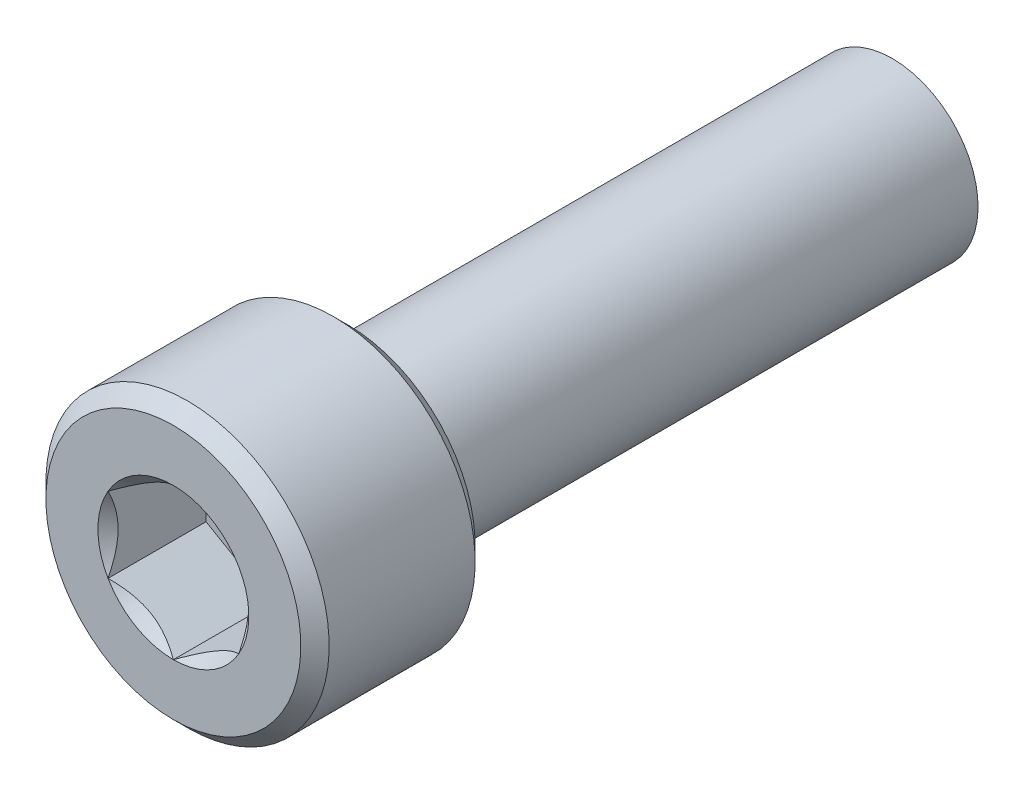
ISO-10303-21;
HEADER;
FILE_DESCRIPTION(('STEP AP214'),'2;1');
FILE_NAME('part.step','',(''),(''),'','','');
FILE_SCHEMA(('AUTOMOTIVE_DESIGN { 1 0 10303 214 1 1 1 1 }'));
ENDSEC;
DATA;
#1=APPLICATION_CONTEXT('core data for automotive mechanical design processes');
#2=APPLICATION_PROTOCOL_DEFINITION('international standard','automotive_design',2000,#1);
#3=PRODUCT_CONTEXT('',#1,'mechanical');
#4=PRODUCT('Part','Part','',(#3));
#5=PRODUCT_RELATED_PRODUCT_CATEGORY('part','',(#4));
#6=PRODUCT_DEFINITION_FORMATION('','',#4);
#7=PRODUCT_DEFINITION_CONTEXT('part definition',#1,'design');
#8=PRODUCT_DEFINITION('design','',#6,#7);
#9=PRODUCT_DEFINITION_SHAPE('','',#8);
#10=(LENGTH_UNIT() NAMED_UNIT(*) SI_UNIT(.MILLI.,.METRE.));
#11=(NAMED_UNIT(*) PLANE_ANGLE_UNIT() SI_UNIT($,.RADIAN.));
#12=(NAMED_UNIT(*) SI_UNIT($,.STERADIAN.) SOLID_ANGLE_UNIT());
#13=UNCERTAINTY_MEASURE_WITH_UNIT(LENGTH_MEASURE(1.E-05),#10,'distance_accuracy_value','');
#14=(GEOMETRIC_REPRESENTATION_CONTEXT(3) GLOBAL_UNCERTAINTY_ASSIGNED_CONTEXT((#13)) GLOBAL_UNIT_ASSIGNED_CONTEXT((#10,
#11,#12)) REPRESENTATION_CONTEXT('',''));
#15=CARTESIAN_POINT('',(0.,0.,0.));
#16=DIRECTION('',(0.,0.,1.));
#17=DIRECTION('',(1.,0.,0.));
#18=AXIS2_PLACEMENT_3D('',#15,#16,#17);
#19=CARTESIAN_POINT('',(3.,-5.19615242270663,3.5));
#20=DIRECTION('',(0.,0.,1.));
#21=DIRECTION('',(0.,-1.,0.));
#22=AXIS2_PLACEMENT_3D('',#19,#20,#21);
#23=PLANE('',#22);
#24=DIRECTION('',(-0.866025403784439,-0.5,0.));
#25=VECTOR('',#24,1.);
#26=CARTESIAN_POINT('',(0.,3.46410161513776,3.5));
#27=LINE('',#26,#25);
#28=CARTESIAN_POINT('',(0.,3.46410161513776,3.5));
#29=VERTEX_POINT('',#28);
#30=CARTESIAN_POINT('',(-3.,1.73205080756888,3.5));
#31=VERTEX_POINT('',#30);
#32=EDGE_CURVE('E82',#29,#31,#27,.T.);
#33=ORIENTED_EDGE('',*,*,#32,.T.);
#34=DIRECTION('',(0.,-1.,0.));
#35=VECTOR('',#34,1.);
#36=CARTESIAN_POINT('',(-3.,1.73205080756888,3.5));
#37=LINE('',#36,#35);
#38=CARTESIAN_POINT('',(-3.,-1.73205080756888,3.5));
#39=VERTEX_POINT('',#38);
#40=EDGE_CURVE('E84',#31,#39,#37,.T.);
#41=ORIENTED_EDGE('',*,*,#40,.T.);
#42=DIRECTION('',(0.866025403784439,-0.5,0.));
#43=VECTOR('',#42,1.);
#44=CARTESIAN_POINT('',(-3.,-1.73205080756888,3.5));
#45=LINE('',#44,#43);
#46=CARTESIAN_POINT('',(0.,-3.46410161513776,3.5));
#47=VERTEX_POINT('',#46);
#48=EDGE_CURVE('E85',#39,#47,#45,.T.);
#49=ORIENTED_EDGE('',*,*,#48,.T.);
#50=DIRECTION('',(0.866025403784439,0.5,0.));
#51=VECTOR('',#50,1.);
#52=CARTESIAN_POINT('',(0.,-3.46410161513776,3.5));
#53=LINE('',#52,#51);
#54=CARTESIAN_POINT('',(3.,-1.73205080756888,3.5));
#55=VERTEX_POINT('',#54);
#56=EDGE_CURVE('E71',#47,#55,#53,.T.);
#57=ORIENTED_EDGE('',*,*,#56,.T.);
#58=DIRECTION('',(0.,1.,0.));
#59=VECTOR('',#58,1.);
#60=CARTESIAN_POINT('',(3.,-1.73205080756888,3.5));
#61=LINE('',#60,#59);
#62=CARTESIAN_POINT('',(3.,1.73205080756888,3.5));
#63=VERTEX_POINT('',#62);
#64=EDGE_CURVE('E110',#55,#63,#61,.T.);
#65=ORIENTED_EDGE('',*,*,#64,.T.);
#66=DIRECTION('',(-0.866025403784439,0.5,0.));
#67=VECTOR('',#66,1.);
#68=CARTESIAN_POINT('',(3.,1.73205080756888,3.5));
#69=LINE('',#68,#67);
#70=EDGE_CURVE('E115',#63,#29,#69,.T.);
#71=ORIENTED_EDGE('',*,*,#70,.T.);
#72=EDGE_LOOP('',(#33,#41,#49,#57,#65,#71));
#73=FACE_BOUND('',#72,.T.);
#74=ADVANCED_FACE('F16',(#73),#23,.T.);
#75=CARTESIAN_POINT('',(-3.,-1.73205080756888,3.5));
#76=DIRECTION('',(-0.5,-0.866025403784439,0.));
#77=DIRECTION('',(0.866025403784439,-0.5,0.));
#78=AXIS2_PLACEMENT_3D('',#75,#76,#77);
#79=PLANE('',#78);
#80=CARTESIAN_POINT('',(-2.99999999999032,-1.7320508075832,8.00000000004136));
#81=CARTESIAN_POINT('',(-2.89688854158698,-1.79158223584331,7.9405256964109));
#82=CARTESIAN_POINT('',(-2.79205304728486,-1.85210903669697,7.88454499927976));
#83=CARTESIAN_POINT('',(-2.57828271602221,-1.97552939499453,7.78204673290586));
#84=CARTESIAN_POINT('',(-2.46932756060096,-2.03843468330721,7.73558617503093));
#85=CARTESIAN_POINT('',(-2.24962485444419,-2.16528009984896,7.65599891925579));
#86=CARTESIAN_POINT('',(-2.13893322488729,-2.2291879419705,7.62267223591901));
#87=CARTESIAN_POINT('',(-1.91511368639457,-2.35841021276905,7.57132616074406));
#88=CARTESIAN_POINT('',(-1.80199261010754,-2.42372069661444,7.55326845527869));
#89=CARTESIAN_POINT('',(-1.60702348021882,-2.53628617623938,7.53697523665388));
#90=CARTESIAN_POINT('',(-1.52542705975241,-2.58339589156056,7.53456399619299));
#91=CARTESIAN_POINT('',(-1.36236704805204,-2.67753863320983,7.53863151806395));
#92=CARTESIAN_POINT('',(-1.28090351339421,-2.72457162687367,7.545113396421));
#93=CARTESIAN_POINT('',(-1.11874833460044,-2.81819196300075,7.56659704587872));
#94=CARTESIAN_POINT('',(-1.03805765621663,-2.86477874788674,7.58160834263353));
#95=CARTESIAN_POINT('',(-0.878062170848356,-2.95715218443323,7.61933151354671));
#96=CARTESIAN_POINT('',(-0.798757258069119,-3.00293889717438,7.64204279713312));
#97=CARTESIAN_POINT('',(-0.657986748130276,-3.08421278898154,7.68876371422157));
#98=CARTESIAN_POINT('',(-0.596209197436678,-3.11988007450436,7.71154386359159));
#99=CARTESIAN_POINT('',(-0.473762853058809,-3.19057450439221,7.76077453974336));
#100=CARTESIAN_POINT('',(-0.413094092865233,-3.22560162942137,7.78722517718446));
#101=CARTESIAN_POINT('',(-0.293056496944738,-3.29490536773894,7.84320408348193));
#102=CARTESIAN_POINT('',(-0.233684247446644,-3.32918395196906,7.87272267287432));
#103=CARTESIAN_POINT('',(-0.116038978212991,-3.39710647983,7.93445005433357));
#104=CARTESIAN_POINT('',(-0.0577653112790005,-3.430750797121,7.96665719768312));
#105=CARTESIAN_POINT('',(-1.43648357031693E-11,-3.46410161512946,8.00000000004499));
#106=B_SPLINE_CURVE_WITH_KNOTS('',3,(#80,#81,#82,#83,#84,#85,#86,#87,#88,#89,#90,#91,#92,#93,
#94,#95,#96,#97,#98,#99,#100,#101,#102,#103,#104,#105),.UNSPECIFIED.,.F.,.F.,(4,2,2,2,2,2,2,2,2,
2,2,2,4),(0.,0.399548839738843,0.801424624392494,1.19691998043515,1.59141997109659,
1.87377108833457,2.15622116274835,2.43898729914404,2.7217317529063,2.94627735487685,
3.17082972801043,3.39469398393905,3.61842195284949),.UNSPECIFIED.);
#107=CARTESIAN_POINT('',(-2.99999999999255,-1.73205080756458,8.00000000004468));
#108=VERTEX_POINT('',#107);
#109=CARTESIAN_POINT('',(5.61843602158199E-12,-3.46410161512591,8.00000000004144));
#110=VERTEX_POINT('',#109);
#111=EDGE_CURVE('E19',#108,#110,#106,.T.);
#112=ORIENTED_EDGE('',*,*,#111,.T.);
#113=DIRECTION('',(0.,0.,1.));
#114=VECTOR('',#113,1.);
#115=CARTESIAN_POINT('',(0.,-3.46410161513776,3.5));
#116=LINE('',#115,#114);
#117=EDGE_CURVE('E90',#110,#47,#116,.F.);
#118=ORIENTED_EDGE('',*,*,#117,.T.);
#119=ORIENTED_EDGE('',*,*,#48,.F.);
#120=DIRECTION('',(0.,0.,1.));
#121=VECTOR('',#120,1.);
#122=CARTESIAN_POINT('',(-3.,-1.73205080756888,3.5));
#123=LINE('',#122,#121);
#124=EDGE_CURVE('E58',#39,#108,#123,.T.);
#125=ORIENTED_EDGE('',*,*,#124,.T.);
#126=EDGE_LOOP('',(#112,#118,#119,#125));
#127=FACE_BOUND('',#126,.T.);
#128=ADVANCED_FACE('F89',(#127),#79,.F.);
#129=CARTESIAN_POINT('',(-3.,1.73205080756888,3.5));
#130=DIRECTION('',(-1.,0.,0.));
#131=DIRECTION('',(0.,-1.,0.));
#132=AXIS2_PLACEMENT_3D('',#129,#130,#131);
#133=PLANE('',#132);
#134=CARTESIAN_POINT('',(-3.00000000000756,1.73205080755334,8.00000000004136));
#135=CARTESIAN_POINT('',(-3.00000000000272,1.61298795102473,7.9405256964109));
#136=CARTESIAN_POINT('',(-3.00000000000073,1.49193434931396,7.88454499927976));
#137=CARTESIAN_POINT('',(-2.99999999999927,1.24509363271631,7.78204673290586));
#138=CARTESIAN_POINT('',(-2.99999999999981,1.11928305609189,7.73558617503093));
#139=CARTESIAN_POINT('',(-3.00000000000019,0.86559222300906,7.65599891925579));
#140=CARTESIAN_POINT('',(-3.00000000000005,0.737776538765718,7.62267223591901));
#141=CARTESIAN_POINT('',(-2.99999999999995,0.479331997168439,7.57132616074405));
#142=CARTESIAN_POINT('',(-2.99999999999999,0.348711029477738,7.55326845527868));
#143=CARTESIAN_POINT('',(-3.00000000000001,0.123580070227885,7.53697523665387));
#144=CARTESIAN_POINT('',(-3.,0.0293606395855113,7.53456399619298));
#145=CARTESIAN_POINT('',(-3.,-0.158924843713037,7.53863151806394));
#146=CARTESIAN_POINT('',(-3.,-0.252990831040703,7.54511339642099));
#147=CARTESIAN_POINT('',(-3.,-0.440231503294856,7.56659704587872));
#148=CARTESIAN_POINT('',(-3.,-0.533405073066836,7.58160834263352));
#149=CARTESIAN_POINT('',(-3.,-0.718151946159826,7.61933151354671));
#150=CARTESIAN_POINT('',(-3.,-0.809725371642131,7.64204279713312));
#151=CARTESIAN_POINT('',(-3.,-0.972273155256436,7.68876371422157));
#152=CARTESIAN_POINT('',(-3.,-1.04360772630208,7.71154386359159));
#153=CARTESIAN_POINT('',(-3.,-1.18499658607778,7.76077453974336));
#154=CARTESIAN_POINT('',(-3.,-1.25505083613611,7.78722517718446));
#155=CARTESIAN_POINT('',(-3.,-1.39365831277125,7.84320408348193));
#156=CARTESIAN_POINT('',(-3.,-1.46221548123149,7.87272267287432));
#157=CARTESIAN_POINT('',(-3.,-1.59806053695336,7.93445005433357));
#158=CARTESIAN_POINT('',(-3.,-1.66534917153537,7.96665719768312));
#159=CARTESIAN_POINT('',(-3.,-1.73205080755229,8.00000000004499));
#160=B_SPLINE_CURVE_WITH_KNOTS('',3,(#134,#135,#136,#137,#138,#139,#140,#141,#142,#143,#144,
#145,#146,#147,#148,#149,#150,#151,#152,#153,#154,#155,#156,#157,#158,#159),.UNSPECIFIED.,.F.,
.F.,(4,2,2,2,2,2,2,2,2,2,2,2,4),(0.,0.399548839738845,0.801424624392497,1.19691998043516,
1.59141997109659,1.87377108833457,2.15622116274836,2.43898729914404,2.7217317529063,
2.94627735487685,3.17082972801044,3.39469398393906,3.6184219528495),.UNSPECIFIED.);
#161=CARTESIAN_POINT('',(-2.99999999999255,1.73205080756458,8.00000000004468));
#162=VERTEX_POINT('',#161);
#163=EDGE_CURVE('E94',#162,#108,#160,.T.);
#164=ORIENTED_EDGE('',*,*,#163,.T.);
#165=ORIENTED_EDGE('',*,*,#124,.F.);
#166=ORIENTED_EDGE('',*,*,#40,.F.);
#167=DIRECTION('',(0.,0.,1.));
#168=VECTOR('',#167,1.);
#169=CARTESIAN_POINT('',(-3.,1.73205080756888,3.5));
#170=LINE('',#169,#168);
#171=EDGE_CURVE('E96',#31,#162,#170,.T.);
#172=ORIENTED_EDGE('',*,*,#171,.T.);
#173=EDGE_LOOP('',(#164,#165,#166,#172));
#174=FACE_BOUND('',#173,.T.);
#175=ADVANCED_FACE('F92',(#174),#133,.F.);
#176=CARTESIAN_POINT('',(0.,3.46410161513776,3.5));
#177=DIRECTION('',(-0.5,0.866025403784439,0.));
#178=DIRECTION('',(-0.866025403784439,-0.5,0.));
#179=AXIS2_PLACEMENT_3D('',#176,#177,#178);
#180=PLANE('',#179);
#181=CARTESIAN_POINT('',(-1.72454109732172E-11,3.46410161513654,8.00000000004137));
#182=CARTESIAN_POINT('',(-0.103111458415738,3.40457018686804,7.9405256964109));
#183=CARTESIAN_POINT('',(-0.207946952715874,3.34404338601093,7.88454499927977));
#184=CARTESIAN_POINT('',(-0.42171728397706,3.22062302771084,7.78204673290587));
#185=CARTESIAN_POINT('',(-0.53067243939885,3.15771773939909,7.73558617503093));
#186=CARTESIAN_POINT('',(-0.750375145556008,3.03087232285802,7.6559989192558));
#187=CARTESIAN_POINT('',(-0.861066775112762,2.96696448073622,7.62267223591901));
#188=CARTESIAN_POINT('',(-1.08488631360538,2.8377422099375,7.57132616074406));
#189=CARTESIAN_POINT('',(-1.19800738989245,2.77243172609218,7.55326845527869));
#190=CARTESIAN_POINT('',(-1.39297651978119,2.65986624646727,7.53697523665388));
#191=CARTESIAN_POINT('',(-1.47457294024759,2.61275653114608,7.53456399619299));
#192=CARTESIAN_POINT('',(-1.63763295194796,2.5186137894968,7.53863151806395));
#193=CARTESIAN_POINT('',(-1.71909648660579,2.47158079583297,7.545113396421));
#194=CARTESIAN_POINT('',(-1.88125166539956,2.37796045970589,7.56659704587872));
#195=CARTESIAN_POINT('',(-1.96194234378338,2.3313736748199,7.58160834263353));
#196=CARTESIAN_POINT('',(-2.12193782915165,2.23900023827341,7.61933151354671));
#197=CARTESIAN_POINT('',(-2.20124274193088,2.19321352553226,7.64204279713312));
#198=CARTESIAN_POINT('',(-2.34201325186973,2.1119396337251,7.68876371422157));
#199=CARTESIAN_POINT('',(-2.40379080256332,2.07627234820228,7.7115438635916));
#200=CARTESIAN_POINT('',(-2.52623714694119,2.00557791831443,7.76077453974336));
#201=CARTESIAN_POINT('',(-2.58690590713477,1.97055079328527,7.78722517718446));
#202=CARTESIAN_POINT('',(-2.70694350305526,1.9012470549677,7.84320408348194));
#203=CARTESIAN_POINT('',(-2.76631575255336,1.86696847073758,7.87272267287432));
#204=CARTESIAN_POINT('',(-2.88396102178701,1.79904594287664,7.93445005433357));
#205=CARTESIAN_POINT('',(-2.942234688721,1.76540162558564,7.96665719768312));
#206=CARTESIAN_POINT('',(-2.99999999998564,1.73205080757718,8.00000000004499));
#207=B_SPLINE_CURVE_WITH_KNOTS('',3,(#181,#182,#183,#184,#185,#186,#187,#188,#189,#190,#191,
#192,#193,#194,#195,#196,#197,#198,#199,#200,#201,#202,#203,#204,#205,#206),.UNSPECIFIED.,.F.,
.F.,(4,2,2,2,2,2,2,2,2,2,2,2,4),(0.,0.399548839738842,0.801424624392494,1.19691998043515,
1.59141997109659,1.87377108833457,2.15622116274835,2.43898729914404,2.7217317529063,
2.94627735487685,3.17082972801043,3.39469398393906,3.61842195284949),.UNSPECIFIED.);
#208=CARTESIAN_POINT('',(0.,3.46410161512916,8.00000000004468));
#209=VERTEX_POINT('',#208);
#210=EDGE_CURVE('E197',#209,#162,#207,.T.);
#211=ORIENTED_EDGE('',*,*,#210,.T.);
#212=ORIENTED_EDGE('',*,*,#171,.F.);
#213=ORIENTED_EDGE('',*,*,#32,.F.);
#214=DIRECTION('',(0.,0.,1.));
#215=VECTOR('',#214,1.);
#216=CARTESIAN_POINT('',(0.,3.46410161513776,3.5));
#217=LINE('',#216,#215);
#218=EDGE_CURVE('E112',#29,#209,#217,.T.);
#219=ORIENTED_EDGE('',*,*,#218,.T.);
#220=EDGE_LOOP('',(#211,#212,#213,#219));
#221=FACE_BOUND('',#220,.T.);
#222=ADVANCED_FACE('F207',(#221),#180,.F.);
#223=CARTESIAN_POINT('',(3.,1.73205080756888,3.5));
#224=DIRECTION('',(0.5,0.866025403784439,0.));
#225=DIRECTION('',(-0.866025403784439,0.5,0.));
#226=AXIS2_PLACEMENT_3D('',#223,#224,#225);
#227=PLANE('',#226);
#228=CARTESIAN_POINT('',(2.99999999999032,1.7320508075832,8.00000000004136));
#229=CARTESIAN_POINT('',(2.89688854158699,1.79158223584331,7.9405256964109));
#230=CARTESIAN_POINT('',(2.79205304728486,1.85210903669697,7.88454499927976));
#231=CARTESIAN_POINT('',(2.57828271602221,1.97552939499453,7.78204673290586));
#232=CARTESIAN_POINT('',(2.46932756060096,2.03843468330721,7.73558617503093));
#233=CARTESIAN_POINT('',(2.24962485444419,2.16528009984896,7.65599891925579));
#234=CARTESIAN_POINT('',(2.13893322488729,2.2291879419705,7.62267223591901));
#235=CARTESIAN_POINT('',(1.91511368639457,2.35841021276906,7.57132616074406));
#236=CARTESIAN_POINT('',(1.80199261010754,2.42372069661444,7.55326845527869));
#237=CARTESIAN_POINT('',(1.60702348021882,2.53628617623938,7.53697523665388));
#238=CARTESIAN_POINT('',(1.52542705975241,2.58339589156056,7.53456399619299));
#239=CARTESIAN_POINT('',(1.36236704805204,2.67753863320983,7.53863151806395));
#240=CARTESIAN_POINT('',(1.28090351339422,2.72457162687367,7.545113396421));
#241=CARTESIAN_POINT('',(1.11874833460044,2.81819196300075,7.56659704587872));
#242=CARTESIAN_POINT('',(1.03805765621663,2.86477874788674,7.58160834263352));
#243=CARTESIAN_POINT('',(0.878062170848357,2.95715218443323,7.61933151354671));
#244=CARTESIAN_POINT('',(0.79875725806912,3.00293889717438,7.64204279713312));
#245=CARTESIAN_POINT('',(0.657986748130277,3.08421278898154,7.68876371422157));
#246=CARTESIAN_POINT('',(0.596209197436679,3.11988007450436,7.71154386359159));
#247=CARTESIAN_POINT('',(0.47376285305881,3.19057450439221,7.76077453974336));
#248=CARTESIAN_POINT('',(0.413094092865233,3.22560162942137,7.78722517718446));
#249=CARTESIAN_POINT('',(0.293056496944738,3.29490536773894,7.84320408348193));
#250=CARTESIAN_POINT('',(0.233684247446644,3.32918395196906,7.87272267287432));
#251=CARTESIAN_POINT('',(0.116038978212991,3.39710647983,7.93445005433357));
#252=CARTESIAN_POINT('',(0.0577653112790009,3.430750797121,7.96665719768312));
#253=CARTESIAN_POINT('',(1.43651801139567E-11,3.46410161512946,8.00000000004499));
#254=B_SPLINE_CURVE_WITH_KNOTS('',3,(#228,#229,#230,#231,#232,#233,#234,#235,#236,#237,#238,
#239,#240,#241,#242,#243,#244,#245,#246,#247,#248,#249,#250,#251,#252,#253),.UNSPECIFIED.,.F.,
.F.,(4,2,2,2,2,2,2,2,2,2,2,2,4),(0.,0.399548839738842,0.801424624392494,1.19691998043515,
1.59141997109659,1.87377108833457,2.15622116274835,2.43898729914404,2.7217317529063,
2.94627735487685,3.17082972801043,3.39469398393906,3.61842195284949),.UNSPECIFIED.);
#255=CARTESIAN_POINT('',(2.99999999999255,1.73205080756458,8.00000000004468));
#256=VERTEX_POINT('',#255);
#257=EDGE_CURVE('E189',#256,#209,#254,.T.);
#258=ORIENTED_EDGE('',*,*,#257,.T.);
#259=ORIENTED_EDGE('',*,*,#218,.F.);
#260=ORIENTED_EDGE('',*,*,#70,.F.);
#261=DIRECTION('',(0.,0.,-1.));
#262=VECTOR('',#261,1.);
#263=CARTESIAN_POINT('',(3.,1.73205080756888,3.5));
#264=LINE('',#263,#262);
#265=EDGE_CURVE('E107',#63,#256,#264,.F.);
#266=ORIENTED_EDGE('',*,*,#265,.T.);
#267=EDGE_LOOP('',(#258,#259,#260,#266));
#268=FACE_BOUND('',#267,.T.);
#269=ADVANCED_FACE('F203',(#268),#227,.F.);
#270=CARTESIAN_POINT('',(3.,-1.73205080756888,3.5));
#271=DIRECTION('',(1.,0.,0.));
#272=DIRECTION('',(0.,0.,-1.));
#273=AXIS2_PLACEMENT_3D('',#270,#271,#272);
#274=PLANE('',#273);
#275=CARTESIAN_POINT('',(3.00000000000756,-1.73205080755334,8.00000000004136));
#276=CARTESIAN_POINT('',(3.00000000000272,-1.61298795102473,7.9405256964109));
#277=CARTESIAN_POINT('',(3.00000000000073,-1.49193434931396,7.88454499927976));
#278=CARTESIAN_POINT('',(2.99999999999927,-1.24509363271631,7.78204673290586));
#279=CARTESIAN_POINT('',(2.99999999999981,-1.11928305609189,7.73558617503093));
#280=CARTESIAN_POINT('',(3.00000000000019,-0.86559222300906,7.65599891925579));
#281=CARTESIAN_POINT('',(3.00000000000005,-0.737776538765717,7.62267223591901));
#282=CARTESIAN_POINT('',(2.99999999999995,-0.479331997168439,7.57132616074405));
#283=CARTESIAN_POINT('',(2.99999999999999,-0.348711029477738,7.55326845527868));
#284=CARTESIAN_POINT('',(3.00000000000001,-0.123580070227885,7.53697523665387));
#285=CARTESIAN_POINT('',(3.,-0.0293606395855116,7.53456399619299));
#286=CARTESIAN_POINT('',(3.,0.158924843713037,7.53863151806395));
#287=CARTESIAN_POINT('',(3.,0.252990831040703,7.54511339642099));
#288=CARTESIAN_POINT('',(3.,0.440231503294856,7.56659704587872));
#289=CARTESIAN_POINT('',(3.,0.533405073066836,7.58160834263352));
#290=CARTESIAN_POINT('',(3.,0.718151946159826,7.61933151354671));
#291=CARTESIAN_POINT('',(3.,0.80972537164213,7.64204279713312));
#292=CARTESIAN_POINT('',(3.,0.972273155256435,7.68876371422157));
#293=CARTESIAN_POINT('',(3.,1.04360772630208,7.71154386359159));
#294=CARTESIAN_POINT('',(3.,1.18499658607778,7.76077453974336));
#295=CARTESIAN_POINT('',(3.,1.25505083613611,7.78722517718446));
#296=CARTESIAN_POINT('',(3.,1.39365831277125,7.84320408348193));
#297=CARTESIAN_POINT('',(3.,1.46221548123149,7.87272267287432));
#298=CARTESIAN_POINT('',(3.,1.59806053695336,7.93445005433357));
#299=CARTESIAN_POINT('',(3.,1.66534917153537,7.96665719768312));
#300=CARTESIAN_POINT('',(3.,1.73205080755229,8.00000000004499));
#301=B_SPLINE_CURVE_WITH_KNOTS('',3,(#275,#276,#277,#278,#279,#280,#281,#282,#283,#284,#285,
#286,#287,#288,#289,#290,#291,#292,#293,#294,#295,#296,#297,#298,#299,#300),.UNSPECIFIED.,.F.,
.F.,(4,2,2,2,2,2,2,2,2,2,2,2,4),(0.,0.399548839738844,0.801424624392497,1.19691998043516,
1.59141997109659,1.87377108833457,2.15622116274836,2.43898729914404,2.7217317529063,
2.94627735487685,3.17082972801044,3.39469398393906,3.6184219528495),.UNSPECIFIED.);
#302=CARTESIAN_POINT('',(2.99999999999255,-1.73205080756458,8.00000000004468));
#303=VERTEX_POINT('',#302);
#304=EDGE_CURVE('E159',#303,#256,#301,.T.);
#305=ORIENTED_EDGE('',*,*,#304,.T.);
#306=ORIENTED_EDGE('',*,*,#265,.F.);
#307=ORIENTED_EDGE('',*,*,#64,.F.);
#308=DIRECTION('',(0.,0.,1.));
#309=VECTOR('',#308,1.);
#310=CARTESIAN_POINT('',(3.,-1.73205080756888,3.5));
#311=LINE('',#310,#309);
#312=EDGE_CURVE('E39',#55,#303,#311,.T.);
#313=ORIENTED_EDGE('',*,*,#312,.T.);
#314=EDGE_LOOP('',(#305,#306,#307,#313));
#315=FACE_BOUND('',#314,.T.);
#316=ADVANCED_FACE('F206',(#315),#274,.F.);
#317=CARTESIAN_POINT('',(0.,-3.46410161513776,3.5));
#318=DIRECTION('',(0.5,-0.866025403784439,0.));
#319=DIRECTION('',(0.866025403784439,0.5,0.));
#320=AXIS2_PLACEMENT_3D('',#317,#318,#319);
#321=PLANE('',#320);
#322=CARTESIAN_POINT('',(1.72473274328695E-11,-3.46410161513653,8.00000000004137));
#323=CARTESIAN_POINT('',(0.10311145841574,-3.40457018686804,7.9405256964109));
#324=CARTESIAN_POINT('',(0.207946952715876,-3.34404338601093,7.88454499927977));
#325=CARTESIAN_POINT('',(0.421717283977062,-3.22062302771084,7.78204673290587));
#326=CARTESIAN_POINT('',(0.530672439398852,-3.15771773939909,7.73558617503094));
#327=CARTESIAN_POINT('',(0.75037514555601,-3.03087232285802,7.6559989192558));
#328=CARTESIAN_POINT('',(0.861066775112763,-2.96696448073622,7.62267223591901));
#329=CARTESIAN_POINT('',(1.08488631360538,-2.8377422099375,7.57132616074406));
#330=CARTESIAN_POINT('',(1.19800738989245,-2.77243172609218,7.55326845527869));
#331=CARTESIAN_POINT('',(1.39297651978119,-2.65986624646727,7.53697523665388));
#332=CARTESIAN_POINT('',(1.47457294024759,-2.61275653114608,7.53456399619299));
#333=CARTESIAN_POINT('',(1.63763295194796,-2.5186137894968,7.53863151806395));
#334=CARTESIAN_POINT('',(1.71909648660579,-2.47158079583297,7.545113396421));
#335=CARTESIAN_POINT('',(1.88125166539956,-2.37796045970589,7.56659704587873));
#336=CARTESIAN_POINT('',(1.96194234378338,-2.3313736748199,7.58160834263353));
#337=CARTESIAN_POINT('',(2.12193782915165,-2.23900023827341,7.61933151354671));
#338=CARTESIAN_POINT('',(2.20124274193088,-2.19321352553225,7.64204279713312));
#339=CARTESIAN_POINT('',(2.34201325186973,-2.1119396337251,7.68876371422157));
#340=CARTESIAN_POINT('',(2.40379080256333,-2.07627234820228,7.7115438635916));
#341=CARTESIAN_POINT('',(2.52623714694119,-2.00557791831443,7.76077453974336));
#342=CARTESIAN_POINT('',(2.58690590713477,-1.97055079328527,7.78722517718447));
#343=CARTESIAN_POINT('',(2.70694350305526,-1.9012470549677,7.84320408348194));
#344=CARTESIAN_POINT('',(2.76631575255336,-1.86696847073758,7.87272267287432));
#345=CARTESIAN_POINT('',(2.88396102178701,-1.79904594287664,7.93445005433357));
#346=CARTESIAN_POINT('',(2.942234688721,-1.76540162558564,7.96665719768313));
#347=CARTESIAN_POINT('',(2.99999999998563,-1.73205080757718,8.00000000004499));
#348=B_SPLINE_CURVE_WITH_KNOTS('',3,(#322,#323,#324,#325,#326,#327,#328,#329,#330,#331,#332,
#333,#334,#335,#336,#337,#338,#339,#340,#341,#342,#343,#344,#345,#346,#347),.UNSPECIFIED.,.F.,
.F.,(4,2,2,2,2,2,2,2,2,2,2,2,4),(0.,0.399548839738842,0.801424624392493,1.19691998043515,
1.59141997109658,1.87377108833456,2.15622116274835,2.43898729914404,2.7217317529063,
2.94627735487685,3.17082972801043,3.39469398393905,3.61842195284948),.UNSPECIFIED.);
#349=EDGE_CURVE('E151',#110,#303,#348,.T.);
#350=ORIENTED_EDGE('',*,*,#349,.T.);
#351=ORIENTED_EDGE('',*,*,#312,.F.);
#352=ORIENTED_EDGE('',*,*,#56,.F.);
#353=ORIENTED_EDGE('',*,*,#117,.F.);
#354=EDGE_LOOP('',(#350,#351,#352,#353));
#355=FACE_BOUND('',#354,.T.);
#356=ADVANCED_FACE('F167',(#355),#321,.F.);
#357=CARTESIAN_POINT('',(0.,0.,7.99999999998136));
#358=DIRECTION('',(0.,0.,1.));
#359=DIRECTION('',(1.,0.,0.));
#360=AXIS2_PLACEMENT_3D('',#357,#358,#359);
#361=CONICAL_SURFACE('',#360,3.46410161506583,0.785398163397448);
#362=ORIENTED_EDGE('',*,*,#111,.F.);
#363=CARTESIAN_POINT('',(0.,0.,8.0000000000382));
#364=DIRECTION('',(0.,0.,1.));
#365=DIRECTION('',(1.,0.,0.));
#366=AXIS2_PLACEMENT_3D('',#363,#364,#365);
#367=CIRCLE('',#366,3.46410161512267);
#368=EDGE_CURVE('E148',#110,#108,#367,.F.);
#369=ORIENTED_EDGE('',*,*,#368,.F.);
#370=EDGE_LOOP('',(#362,#369));
#371=FACE_BOUND('',#370,.T.);
#372=ADVANCED_FACE('F224',(#371),#361,.F.);
#373=CARTESIAN_POINT('',(0.,0.,7.99999999998136));
#374=DIRECTION('',(0.,0.,1.));
#375=DIRECTION('',(1.,0.,0.));
#376=AXIS2_PLACEMENT_3D('',#373,#374,#375);
#377=CONICAL_SURFACE('',#376,3.46410161506583,0.785398163397448);
#378=CARTESIAN_POINT('',(0.,0.,8.0000000000382));
#379=DIRECTION('',(0.,0.,1.));
#380=DIRECTION('',(1.,0.,0.));
#381=AXIS2_PLACEMENT_3D('',#378,#379,#380);
#382=CIRCLE('',#381,3.46410161512267);
#383=EDGE_CURVE('E145',#108,#162,#382,.F.);
#384=ORIENTED_EDGE('',*,*,#383,.F.);
#385=ORIENTED_EDGE('',*,*,#163,.F.);
#386=EDGE_LOOP('',(#384,#385));
#387=FACE_BOUND('',#386,.T.);
#388=ADVANCED_FACE('F221',(#387),#377,.F.);
#389=CARTESIAN_POINT('',(0.,0.,7.99999999998136));
#390=DIRECTION('',(0.,0.,1.));
#391=DIRECTION('',(1.,0.,0.));
#392=AXIS2_PLACEMENT_3D('',#389,#390,#391);
#393=CONICAL_SURFACE('',#392,3.46410161506583,0.785398163397448);
#394=ORIENTED_EDGE('',*,*,#210,.F.);
#395=CARTESIAN_POINT('',(0.,0.,8.0000000000382));
#396=DIRECTION('',(0.,0.,1.));
#397=DIRECTION('',(1.,0.,0.));
#398=AXIS2_PLACEMENT_3D('',#395,#396,#397);
#399=CIRCLE('',#398,3.46410161512267);
#400=EDGE_CURVE('E142',#162,#209,#399,.F.);
#401=ORIENTED_EDGE('',*,*,#400,.F.);
#402=EDGE_LOOP('',(#394,#401));
#403=FACE_BOUND('',#402,.T.);
#404=ADVANCED_FACE('F185',(#403),#393,.F.);
#405=CARTESIAN_POINT('',(0.,0.,7.99999999998136));
#406=DIRECTION('',(0.,0.,1.));
#407=DIRECTION('',(1.,0.,0.));
#408=AXIS2_PLACEMENT_3D('',#405,#406,#407);
#409=CONICAL_SURFACE('',#408,3.46410161506583,0.785398163397448);
#410=ORIENTED_EDGE('',*,*,#257,.F.);
#411=CARTESIAN_POINT('',(0.,0.,8.0000000000382));
#412=DIRECTION('',(0.,0.,1.));
#413=DIRECTION('',(1.,0.,0.));
#414=AXIS2_PLACEMENT_3D('',#411,#412,#413);
#415=CIRCLE('',#414,3.46410161512267);
#416=EDGE_CURVE('E139',#209,#256,#415,.F.);
#417=ORIENTED_EDGE('',*,*,#416,.F.);
#418=EDGE_LOOP('',(#410,#417));
#419=FACE_BOUND('',#418,.T.);
#420=ADVANCED_FACE('F180',(#419),#409,.F.);
#421=CARTESIAN_POINT('',(0.,0.,7.99999999998136));
#422=DIRECTION('',(0.,0.,1.));
#423=DIRECTION('',(1.,0.,0.));
#424=AXIS2_PLACEMENT_3D('',#421,#422,#423);
#425=CONICAL_SURFACE('',#424,3.46410161506583,0.785398163397448);
#426=ORIENTED_EDGE('',*,*,#304,.F.);
#427=CARTESIAN_POINT('',(0.,0.,8.0000000000382));
#428=DIRECTION('',(0.,0.,1.));
#429=DIRECTION('',(1.,0.,0.));
#430=AXIS2_PLACEMENT_3D('',#427,#428,#429);
#431=CIRCLE('',#430,3.46410161512267);
#432=EDGE_CURVE('E136',#256,#303,#431,.F.);
#433=ORIENTED_EDGE('',*,*,#432,.F.);
#434=EDGE_LOOP('',(#426,#433));
#435=FACE_BOUND('',#434,.T.);
#436=ADVANCED_FACE('F174',(#435),#425,.F.);
#437=CARTESIAN_POINT('',(0.,0.,7.99999999998136));
#438=DIRECTION('',(0.,0.,1.));
#439=DIRECTION('',(1.,0.,0.));
#440=AXIS2_PLACEMENT_3D('',#437,#438,#439);
#441=CONICAL_SURFACE('',#440,3.46410161506583,0.785398163397448);
#442=ORIENTED_EDGE('',*,*,#349,.F.);
#443=CARTESIAN_POINT('',(0.,0.,8.0000000000382));
#444=DIRECTION('',(0.,0.,1.));
#445=DIRECTION('',(1.,0.,0.));
#446=AXIS2_PLACEMENT_3D('',#443,#444,#445);
#447=CIRCLE('',#446,3.46410161512267);
#448=EDGE_CURVE('E133',#303,#110,#447,.F.);
#449=ORIENTED_EDGE('',*,*,#448,.F.);
#450=EDGE_LOOP('',(#442,#449));
#451=FACE_BOUND('',#450,.T.);
#452=ADVANCED_FACE('F169',(#451),#441,.F.);
#453=CARTESIAN_POINT('',(0.,0.,8.));
#454=DIRECTION('',(0.,0.,1.));
#455=DIRECTION('',(0.,-1.,0.));
#456=AXIS2_PLACEMENT_3D('',#453,#454,#455);
#457=PLANE('',#456);
#458=ORIENTED_EDGE('',*,*,#432,.T.);
#459=ORIENTED_EDGE('',*,*,#448,.T.);
#460=ORIENTED_EDGE('',*,*,#368,.T.);
#461=ORIENTED_EDGE('',*,*,#383,.T.);
#462=ORIENTED_EDGE('',*,*,#400,.T.);
#463=ORIENTED_EDGE('',*,*,#416,.T.);
#464=EDGE_LOOP('',(#458,#459,#460,#461,#462,#463));
#465=FACE_BOUND('',#464,.T.);
#466=CARTESIAN_POINT('',(0.,0.,7.99999999998136));
#467=DIRECTION('',(0.,0.,-1.));
#468=DIRECTION('',(0.,1.,0.));
#469=AXIS2_PLACEMENT_3D('',#466,#467,#468);
#470=CIRCLE('',#469,5.8500000000663);
#471=CARTESIAN_POINT('',(0.,5.8500000000663,7.99999999998136));
#472=VERTEX_POINT('',#471);
#473=EDGE_CURVE('E129',#472,#472,#470,.T.);
#474=ORIENTED_EDGE('',*,*,#473,.F.);
#475=EDGE_LOOP('',(#474));
#476=FACE_BOUND('',#475,.T.);
#477=ADVANCED_FACE('F173',(#465,#476),#457,.T.);
#478=CARTESIAN_POINT('',(0.,0.,7.35000000003083));
#479=DIRECTION('',(0.,0.,-1.));
#480=DIRECTION('',(0.,1.,0.));
#481=AXIS2_PLACEMENT_3D('',#478,#479,#480);
#482=CONICAL_SURFACE('',#481,6.50000000001683,0.785398163397448);
#483=ORIENTED_EDGE('',*,*,#473,.T.);
#484=EDGE_LOOP('',(#483));
#485=FACE_BOUND('',#484,.T.);
#486=CARTESIAN_POINT('',(0.,0.,7.34999999999999));
#487=DIRECTION('',(0.,0.,-1.));
#488=DIRECTION('',(0.,1.,0.));
#489=AXIS2_PLACEMENT_3D('',#486,#487,#488);
#490=CIRCLE('',#489,6.5);
#491=CARTESIAN_POINT('',(0.,6.5,7.34999999999999));
#492=VERTEX_POINT('',#491);
#493=EDGE_CURVE('E132',#492,#492,#490,.T.);
#494=ORIENTED_EDGE('',*,*,#493,.F.);
#495=EDGE_LOOP('',(#494));
#496=FACE_BOUND('',#495,.T.);
#497=ADVANCED_FACE('F256',(#485,#496),#482,.T.);
#498=CARTESIAN_POINT('',(0.,0.,8.));
#499=DIRECTION('',(0.,0.,-1.));
#500=DIRECTION('',(0.,1.,0.));
#501=AXIS2_PLACEMENT_3D('',#498,#499,#500);
#502=CYLINDRICAL_SURFACE('',#501,6.5);
#503=ORIENTED_EDGE('',*,*,#493,.T.);
#504=EDGE_LOOP('',(#503));
#505=FACE_BOUND('',#504,.T.);
#506=CARTESIAN_POINT('',(0.,0.,0.650000000007367));
#507=DIRECTION('',(0.,0.,1.));
#508=DIRECTION('',(-1.,0.,0.));
#509=AXIS2_PLACEMENT_3D('',#506,#507,#508);
#510=CIRCLE('',#509,6.50000000001683);
#511=CARTESIAN_POINT('',(-6.50000000001682,0.,0.650000000007367));
#512=VERTEX_POINT('',#511);
#513=EDGE_CURVE('E128',#512,#512,#510,.F.);
#514=ORIENTED_EDGE('',*,*,#513,.F.);
#515=EDGE_LOOP('',(#514));
#516=FACE_BOUND('',#515,.T.);
#517=ADVANCED_FACE('F253',(#505,#516),#502,.T.);
#518=CARTESIAN_POINT('',(0.,0.,0.650000000007367));
#519=DIRECTION('',(0.,0.,1.));
#520=DIRECTION('',(0.,-1.,0.));
#521=AXIS2_PLACEMENT_3D('',#518,#519,#520);
#522=CONICAL_SURFACE('',#521,6.50000000001683,0.785398163397448);
#523=CARTESIAN_POINT('',(0.,0.,5.6843418860808E-11));
#524=DIRECTION('',(0.,0.,1.));
#525=DIRECTION('',(0.,-1.,0.));
#526=AXIS2_PLACEMENT_3D('',#523,#524,#525);
#527=CIRCLE('',#526,5.8500000000663);
#528=CARTESIAN_POINT('',(0.,-5.8500000000663,5.68441506972745E-11));
#529=VERTEX_POINT('',#528);
#530=EDGE_CURVE('E125',#529,#529,#527,.T.);
#531=ORIENTED_EDGE('',*,*,#530,.T.);
#532=EDGE_LOOP('',(#531));
#533=FACE_BOUND('',#532,.T.);
#534=ORIENTED_EDGE('',*,*,#513,.T.);
#535=EDGE_LOOP('',(#534));
#536=FACE_BOUND('',#535,.T.);
#537=ADVANCED_FACE('F249',(#533,#536),#522,.T.);
#538=CARTESIAN_POINT('',(0.,0.,-25.));
#539=DIRECTION('',(0.,0.,-1.));
#540=DIRECTION('',(0.,1.,0.));
#541=AXIS2_PLACEMENT_3D('',#538,#539,#540);
#542=PLANE('',#541);
#543=CARTESIAN_POINT('',(0.,0.,-25.));
#544=DIRECTION('',(0.,0.,-1.));
#545=DIRECTION('',(0.,1.,0.));
#546=AXIS2_PLACEMENT_3D('',#543,#544,#545);
#547=CIRCLE('',#546,3.933);
#548=CARTESIAN_POINT('',(0.,3.933,-25.));
#549=VERTEX_POINT('',#548);
#550=EDGE_CURVE('E30',#549,#549,#547,.F.);
#551=ORIENTED_EDGE('',*,*,#550,.F.);
#552=EDGE_LOOP('',(#551));
#553=FACE_BOUND('',#552,.T.);
#554=ADVANCED_FACE('F242',(#553),#542,.T.);
#555=CARTESIAN_POINT('',(0.,0.,0.));
#556=DIRECTION('',(0.,0.,1.));
#557=DIRECTION('',(0.,-1.,0.));
#558=AXIS2_PLACEMENT_3D('',#555,#556,#557);
#559=PLANE('',#558);
#560=CARTESIAN_POINT('',(0.,0.,0.));
#561=DIRECTION('',(0.,0.,-1.));
#562=DIRECTION('',(0.,1.,0.));
#563=AXIS2_PLACEMENT_3D('',#560,#561,#562);
#564=CIRCLE('',#563,3.933);
#565=CARTESIAN_POINT('',(0.,3.933,0.));
#566=VERTEX_POINT('',#565);
#567=EDGE_CURVE('E11',#566,#566,#564,.T.);
#568=ORIENTED_EDGE('',*,*,#567,.F.);
#569=EDGE_LOOP('',(#568));
#570=FACE_BOUND('',#569,.T.);
#571=ORIENTED_EDGE('',*,*,#530,.F.);
#572=EDGE_LOOP('',(#571));
#573=FACE_BOUND('',#572,.T.);
#574=ADVANCED_FACE('F236',(#570,#573),#559,.F.);
#575=CARTESIAN_POINT('',(0.,0.,0.));
#576=DIRECTION('',(0.,0.,-1.));
#577=DIRECTION('',(0.,1.,0.));
#578=AXIS2_PLACEMENT_3D('',#575,#576,#577);
#579=CYLINDRICAL_SURFACE('',#578,3.933);
#580=ORIENTED_EDGE('',*,*,#567,.T.);
#581=EDGE_LOOP('',(#580));
#582=FACE_BOUND('',#581,.T.);
#583=ORIENTED_EDGE('',*,*,#550,.T.);
#584=EDGE_LOOP('',(#583));
#585=FACE_BOUND('',#584,.T.);
#586=ADVANCED_FACE('F234',(#582,#585),#579,.T.);
#587=CLOSED_SHELL('',(#74,#128,#175,#222,#269,#316,#356,#372,#388,#404,#420,#436,#452,#477,#497,
#517,#537,#554,#574,#586));
#588=MANIFOLD_SOLID_BREP('B1',#587);
#589=ADVANCED_BREP_SHAPE_REPRESENTATION('',(#18,#588),#14);
#590=SHAPE_DEFINITION_REPRESENTATION(#9,#589);
ENDSEC;
END-ISO-10303-21;
